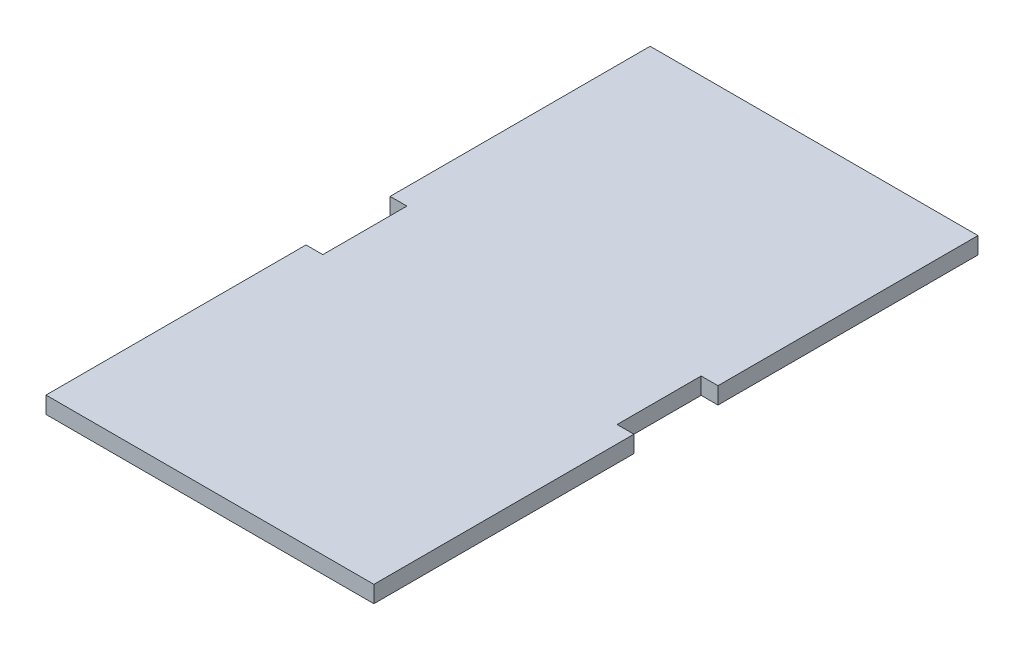
ISO-10303-21;
HEADER;
FILE_DESCRIPTION(('STEP AP214'),'2;1');
FILE_NAME('part.step','',(''),(''),'','','');
FILE_SCHEMA(('AUTOMOTIVE_DESIGN { 1 0 10303 214 1 1 1 1 }'));
ENDSEC;
DATA;
#1=APPLICATION_CONTEXT('core data for automotive mechanical design processes');
#2=APPLICATION_PROTOCOL_DEFINITION('international standard','automotive_design',2000,#1);
#3=PRODUCT_CONTEXT('',#1,'mechanical');
#4=PRODUCT('Part','Part','',(#3));
#5=PRODUCT_RELATED_PRODUCT_CATEGORY('part','',(#4));
#6=PRODUCT_DEFINITION_FORMATION('','',#4);
#7=PRODUCT_DEFINITION_CONTEXT('part definition',#1,'design');
#8=PRODUCT_DEFINITION('design','',#6,#7);
#9=PRODUCT_DEFINITION_SHAPE('','',#8);
#10=(LENGTH_UNIT() NAMED_UNIT(*) SI_UNIT(.MILLI.,.METRE.));
#11=(NAMED_UNIT(*) PLANE_ANGLE_UNIT() SI_UNIT($,.RADIAN.));
#12=(NAMED_UNIT(*) SI_UNIT($,.STERADIAN.) SOLID_ANGLE_UNIT());
#13=UNCERTAINTY_MEASURE_WITH_UNIT(LENGTH_MEASURE(1.E-05),#10,'distance_accuracy_value','');
#14=(GEOMETRIC_REPRESENTATION_CONTEXT(3) GLOBAL_UNCERTAINTY_ASSIGNED_CONTEXT((#13)) GLOBAL_UNIT_ASSIGNED_CONTEXT((#10,
#11,#12)) REPRESENTATION_CONTEXT('',''));
#15=CARTESIAN_POINT('',(0.,0.,0.));
#16=DIRECTION('',(0.,0.,1.));
#17=DIRECTION('',(1.,0.,0.));
#18=AXIS2_PLACEMENT_3D('',#15,#16,#17);
#19=CARTESIAN_POINT('',(44.45,5.08,0.));
#20=DIRECTION('',(1.,0.,0.));
#21=DIRECTION('',(0.,0.,-1.));
#22=AXIS2_PLACEMENT_3D('',#19,#20,#21);
#23=PLANE('',#22);
#24=DIRECTION('',(0.,0.,1.));
#25=VECTOR('',#24,1.);
#26=CARTESIAN_POINT('',(44.45,0.,0.));
#27=LINE('',#26,#25);
#28=CARTESIAN_POINT('',(44.45,0.,-12.7));
#29=VERTEX_POINT('',#28);
#30=CARTESIAN_POINT('',(44.45,0.,12.7));
#31=VERTEX_POINT('',#30);
#32=EDGE_CURVE('E152',#29,#31,#27,.T.);
#33=ORIENTED_EDGE('',*,*,#32,.F.);
#34=DIRECTION('',(0.,-1.,0.));
#35=VECTOR('',#34,1.);
#36=CARTESIAN_POINT('',(44.45,5.08,-12.7));
#37=LINE('',#36,#35);
#38=CARTESIAN_POINT('',(44.45,5.08,-12.7));
#39=VERTEX_POINT('',#38);
#40=EDGE_CURVE('E11',#39,#29,#37,.T.);
#41=ORIENTED_EDGE('',*,*,#40,.F.);
#42=DIRECTION('',(0.,0.,1.));
#43=VECTOR('',#42,1.);
#44=CARTESIAN_POINT('',(44.45,5.08,0.));
#45=LINE('',#44,#43);
#46=CARTESIAN_POINT('',(44.45,5.08,12.7));
#47=VERTEX_POINT('',#46);
#48=EDGE_CURVE('E183',#39,#47,#45,.T.);
#49=ORIENTED_EDGE('',*,*,#48,.T.);
#50=DIRECTION('',(0.,-1.,0.));
#51=VECTOR('',#50,1.);
#52=CARTESIAN_POINT('',(44.45,5.08,12.7));
#53=LINE('',#52,#51);
#54=EDGE_CURVE('E51',#47,#31,#53,.T.);
#55=ORIENTED_EDGE('',*,*,#54,.T.);
#56=EDGE_LOOP('',(#33,#41,#49,#55));
#57=FACE_BOUND('',#56,.T.);
#58=ADVANCED_FACE('F35',(#57),#23,.T.);
#59=CARTESIAN_POINT('',(0.,5.08,-12.6999999999999));
#60=DIRECTION('',(0.,0.,-1.));
#61=DIRECTION('',(-1.,0.,0.));
#62=AXIS2_PLACEMENT_3D('',#59,#60,#61);
#63=PLANE('',#62);
#64=DIRECTION('',(1.,0.,0.));
#65=VECTOR('',#64,1.);
#66=CARTESIAN_POINT('',(0.,0.,-12.6999999999999));
#67=LINE('',#66,#65);
#68=CARTESIAN_POINT('',(49.53,0.,-12.7));
#69=VERTEX_POINT('',#68);
#70=EDGE_CURVE('E154',#29,#69,#67,.T.);
#71=ORIENTED_EDGE('',*,*,#70,.T.);
#72=DIRECTION('',(0.,-1.,0.));
#73=VECTOR('',#72,1.);
#74=CARTESIAN_POINT('',(49.53,5.08,-12.7));
#75=LINE('',#74,#73);
#76=CARTESIAN_POINT('',(49.53,5.08,-12.7));
#77=VERTEX_POINT('',#76);
#78=EDGE_CURVE('E43',#77,#69,#75,.T.);
#79=ORIENTED_EDGE('',*,*,#78,.F.);
#80=DIRECTION('',(1.,0.,0.));
#81=VECTOR('',#80,1.);
#82=CARTESIAN_POINT('',(0.,5.08,-12.6999999999999));
#83=LINE('',#82,#81);
#84=EDGE_CURVE('E219',#39,#77,#83,.T.);
#85=ORIENTED_EDGE('',*,*,#84,.F.);
#86=ORIENTED_EDGE('',*,*,#40,.T.);
#87=EDGE_LOOP('',(#71,#79,#85,#86));
#88=FACE_BOUND('',#87,.T.);
#89=ADVANCED_FACE('F208',(#88),#63,.F.);
#90=CARTESIAN_POINT('',(49.53,5.08,0.));
#91=DIRECTION('',(1.,0.,0.));
#92=DIRECTION('',(0.,0.,-1.));
#93=AXIS2_PLACEMENT_3D('',#90,#91,#92);
#94=PLANE('',#93);
#95=DIRECTION('',(0.,0.,1.));
#96=VECTOR('',#95,1.);
#97=CARTESIAN_POINT('',(49.53,0.,0.));
#98=LINE('',#97,#96);
#99=CARTESIAN_POINT('',(49.53,0.,-91.2622));
#100=VERTEX_POINT('',#99);
#101=EDGE_CURVE('E157',#100,#69,#98,.T.);
#102=ORIENTED_EDGE('',*,*,#101,.F.);
#103=DIRECTION('',(0.,-1.,0.));
#104=VECTOR('',#103,1.);
#105=CARTESIAN_POINT('',(49.53,5.08,-91.2622));
#106=LINE('',#105,#104);
#107=CARTESIAN_POINT('',(49.53,5.08,-91.2622));
#108=VERTEX_POINT('',#107);
#109=EDGE_CURVE('E198',#108,#100,#106,.T.);
#110=ORIENTED_EDGE('',*,*,#109,.F.);
#111=DIRECTION('',(0.,0.,1.));
#112=VECTOR('',#111,1.);
#113=CARTESIAN_POINT('',(49.53,5.08,0.));
#114=LINE('',#113,#112);
#115=EDGE_CURVE('E205',#108,#77,#114,.T.);
#116=ORIENTED_EDGE('',*,*,#115,.T.);
#117=ORIENTED_EDGE('',*,*,#78,.T.);
#118=EDGE_LOOP('',(#102,#110,#116,#117));
#119=FACE_BOUND('',#118,.T.);
#120=ADVANCED_FACE('F203',(#119),#94,.T.);
#121=CARTESIAN_POINT('',(0.,5.08,-91.2622));
#122=DIRECTION('',(0.,0.,-1.));
#123=DIRECTION('',(-1.,0.,0.));
#124=AXIS2_PLACEMENT_3D('',#121,#122,#123);
#125=PLANE('',#124);
#126=DIRECTION('',(1.,0.,0.));
#127=VECTOR('',#126,1.);
#128=CARTESIAN_POINT('',(0.,0.,-91.2622));
#129=LINE('',#128,#127);
#130=CARTESIAN_POINT('',(-49.53,0.,-91.2622));
#131=VERTEX_POINT('',#130);
#132=EDGE_CURVE('E160',#131,#100,#129,.T.);
#133=ORIENTED_EDGE('',*,*,#132,.F.);
#134=DIRECTION('',(0.,-1.,0.));
#135=VECTOR('',#134,1.);
#136=CARTESIAN_POINT('',(-49.53,5.08,-91.2622));
#137=LINE('',#136,#135);
#138=CARTESIAN_POINT('',(-49.53,5.08,-91.2622));
#139=VERTEX_POINT('',#138);
#140=EDGE_CURVE('E196',#139,#131,#137,.T.);
#141=ORIENTED_EDGE('',*,*,#140,.F.);
#142=DIRECTION('',(1.,0.,0.));
#143=VECTOR('',#142,1.);
#144=CARTESIAN_POINT('',(0.,5.08,-91.2622));
#145=LINE('',#144,#143);
#146=EDGE_CURVE('E218',#139,#108,#145,.T.);
#147=ORIENTED_EDGE('',*,*,#146,.T.);
#148=ORIENTED_EDGE('',*,*,#109,.T.);
#149=EDGE_LOOP('',(#133,#141,#147,#148));
#150=FACE_BOUND('',#149,.T.);
#151=ADVANCED_FACE('F214',(#150),#125,.T.);
#152=CARTESIAN_POINT('',(-49.53,5.08,0.));
#153=DIRECTION('',(1.,0.,0.));
#154=DIRECTION('',(0.,0.,-1.));
#155=AXIS2_PLACEMENT_3D('',#152,#153,#154);
#156=PLANE('',#155);
#157=DIRECTION('',(0.,0.,1.));
#158=VECTOR('',#157,1.);
#159=CARTESIAN_POINT('',(-49.53,0.,0.));
#160=LINE('',#159,#158);
#161=CARTESIAN_POINT('',(-49.53,0.,-12.7));
#162=VERTEX_POINT('',#161);
#163=EDGE_CURVE('E163',#131,#162,#160,.T.);
#164=ORIENTED_EDGE('',*,*,#163,.T.);
#165=DIRECTION('',(0.,-1.,0.));
#166=VECTOR('',#165,1.);
#167=CARTESIAN_POINT('',(-49.53,5.08,-12.7));
#168=LINE('',#167,#166);
#169=CARTESIAN_POINT('',(-49.53,5.08,-12.7));
#170=VERTEX_POINT('',#169);
#171=EDGE_CURVE('E194',#170,#162,#168,.T.);
#172=ORIENTED_EDGE('',*,*,#171,.F.);
#173=DIRECTION('',(0.,0.,1.));
#174=VECTOR('',#173,1.);
#175=CARTESIAN_POINT('',(-49.53,5.08,0.));
#176=LINE('',#175,#174);
#177=EDGE_CURVE('E221',#139,#170,#176,.T.);
#178=ORIENTED_EDGE('',*,*,#177,.F.);
#179=ORIENTED_EDGE('',*,*,#140,.T.);
#180=EDGE_LOOP('',(#164,#172,#178,#179));
#181=FACE_BOUND('',#180,.T.);
#182=ADVANCED_FACE('F259',(#181),#156,.F.);
#183=CARTESIAN_POINT('',(0.,5.08,-12.7));
#184=DIRECTION('',(0.,0.,1.));
#185=DIRECTION('',(1.,0.,0.));
#186=AXIS2_PLACEMENT_3D('',#183,#184,#185);
#187=PLANE('',#186);
#188=DIRECTION('',(-1.,0.,0.));
#189=VECTOR('',#188,1.);
#190=CARTESIAN_POINT('',(0.,0.,-12.7));
#191=LINE('',#190,#189);
#192=CARTESIAN_POINT('',(-44.45,0.,-12.7));
#193=VERTEX_POINT('',#192);
#194=EDGE_CURVE('E166',#193,#162,#191,.T.);
#195=ORIENTED_EDGE('',*,*,#194,.F.);
#196=DIRECTION('',(0.,-1.,0.));
#197=VECTOR('',#196,1.);
#198=CARTESIAN_POINT('',(-44.45,5.08,-12.7));
#199=LINE('',#198,#197);
#200=CARTESIAN_POINT('',(-44.45,5.08,-12.7));
#201=VERTEX_POINT('',#200);
#202=EDGE_CURVE('E192',#201,#193,#199,.T.);
#203=ORIENTED_EDGE('',*,*,#202,.F.);
#204=DIRECTION('',(-1.,0.,0.));
#205=VECTOR('',#204,1.);
#206=CARTESIAN_POINT('',(0.,5.08,-12.7));
#207=LINE('',#206,#205);
#208=EDGE_CURVE('E227',#201,#170,#207,.T.);
#209=ORIENTED_EDGE('',*,*,#208,.T.);
#210=ORIENTED_EDGE('',*,*,#171,.T.);
#211=EDGE_LOOP('',(#195,#203,#209,#210));
#212=FACE_BOUND('',#211,.T.);
#213=ADVANCED_FACE('F262',(#212),#187,.T.);
#214=CARTESIAN_POINT('',(-44.45,5.08,0.));
#215=DIRECTION('',(1.,0.,0.));
#216=DIRECTION('',(0.,0.,-1.));
#217=AXIS2_PLACEMENT_3D('',#214,#215,#216);
#218=PLANE('',#217);
#219=DIRECTION('',(0.,0.,1.));
#220=VECTOR('',#219,1.);
#221=CARTESIAN_POINT('',(-44.45,0.,0.));
#222=LINE('',#221,#220);
#223=CARTESIAN_POINT('',(-44.45,0.,12.7));
#224=VERTEX_POINT('',#223);
#225=EDGE_CURVE('E169',#193,#224,#222,.T.);
#226=ORIENTED_EDGE('',*,*,#225,.T.);
#227=DIRECTION('',(0.,-1.,0.));
#228=VECTOR('',#227,1.);
#229=CARTESIAN_POINT('',(-44.45,5.08,12.7));
#230=LINE('',#229,#228);
#231=CARTESIAN_POINT('',(-44.45,5.08,12.7));
#232=VERTEX_POINT('',#231);
#233=EDGE_CURVE('E189',#232,#224,#230,.T.);
#234=ORIENTED_EDGE('',*,*,#233,.F.);
#235=DIRECTION('',(0.,0.,1.));
#236=VECTOR('',#235,1.);
#237=CARTESIAN_POINT('',(-44.45,5.08,0.));
#238=LINE('',#237,#236);
#239=EDGE_CURVE('E230',#201,#232,#238,.T.);
#240=ORIENTED_EDGE('',*,*,#239,.F.);
#241=ORIENTED_EDGE('',*,*,#202,.T.);
#242=EDGE_LOOP('',(#226,#234,#240,#241));
#243=FACE_BOUND('',#242,.T.);
#244=ADVANCED_FACE('F266',(#243),#218,.F.);
#245=CARTESIAN_POINT('',(0.,5.08,12.7));
#246=DIRECTION('',(0.,0.,1.));
#247=DIRECTION('',(1.,0.,0.));
#248=AXIS2_PLACEMENT_3D('',#245,#246,#247);
#249=PLANE('',#248);
#250=DIRECTION('',(-1.,0.,0.));
#251=VECTOR('',#250,1.);
#252=CARTESIAN_POINT('',(0.,0.,12.7));
#253=LINE('',#252,#251);
#254=CARTESIAN_POINT('',(-49.53,0.,12.7));
#255=VERTEX_POINT('',#254);
#256=EDGE_CURVE('E171',#224,#255,#253,.T.);
#257=ORIENTED_EDGE('',*,*,#256,.T.);
#258=DIRECTION('',(0.,-1.,0.));
#259=VECTOR('',#258,1.);
#260=CARTESIAN_POINT('',(-49.53,5.08,12.7));
#261=LINE('',#260,#259);
#262=CARTESIAN_POINT('',(-49.53,5.08,12.7));
#263=VERTEX_POINT('',#262);
#264=EDGE_CURVE('E187',#263,#255,#261,.T.);
#265=ORIENTED_EDGE('',*,*,#264,.F.);
#266=DIRECTION('',(-1.,0.,0.));
#267=VECTOR('',#266,1.);
#268=CARTESIAN_POINT('',(0.,5.08,12.7));
#269=LINE('',#268,#267);
#270=EDGE_CURVE('E232',#232,#263,#269,.T.);
#271=ORIENTED_EDGE('',*,*,#270,.F.);
#272=ORIENTED_EDGE('',*,*,#233,.T.);
#273=EDGE_LOOP('',(#257,#265,#271,#272));
#274=FACE_BOUND('',#273,.T.);
#275=ADVANCED_FACE('F270',(#274),#249,.F.);
#276=CARTESIAN_POINT('',(-49.53,5.08,0.));
#277=DIRECTION('',(-1.,0.,0.));
#278=DIRECTION('',(0.,0.,1.));
#279=AXIS2_PLACEMENT_3D('',#276,#277,#278);
#280=PLANE('',#279);
#281=DIRECTION('',(0.,0.,-1.));
#282=VECTOR('',#281,1.);
#283=CARTESIAN_POINT('',(-49.53,0.,0.));
#284=LINE('',#283,#282);
#285=CARTESIAN_POINT('',(-49.53,0.,91.2622));
#286=VERTEX_POINT('',#285);
#287=EDGE_CURVE('E174',#286,#255,#284,.T.);
#288=ORIENTED_EDGE('',*,*,#287,.F.);
#289=DIRECTION('',(0.,-1.,0.));
#290=VECTOR('',#289,1.);
#291=CARTESIAN_POINT('',(-49.53,5.08,91.2622));
#292=LINE('',#291,#290);
#293=CARTESIAN_POINT('',(-49.53,5.08,91.2622));
#294=VERTEX_POINT('',#293);
#295=EDGE_CURVE('E144',#294,#286,#292,.T.);
#296=ORIENTED_EDGE('',*,*,#295,.F.);
#297=DIRECTION('',(0.,0.,-1.));
#298=VECTOR('',#297,1.);
#299=CARTESIAN_POINT('',(-49.53,5.08,0.));
#300=LINE('',#299,#298);
#301=EDGE_CURVE('E134',#294,#263,#300,.T.);
#302=ORIENTED_EDGE('',*,*,#301,.T.);
#303=ORIENTED_EDGE('',*,*,#264,.T.);
#304=EDGE_LOOP('',(#288,#296,#302,#303));
#305=FACE_BOUND('',#304,.T.);
#306=ADVANCED_FACE('F235',(#305),#280,.T.);
#307=CARTESIAN_POINT('',(0.,5.08,91.2622));
#308=DIRECTION('',(0.,0.,-1.));
#309=DIRECTION('',(-1.,0.,0.));
#310=AXIS2_PLACEMENT_3D('',#307,#308,#309);
#311=PLANE('',#310);
#312=DIRECTION('',(1.,0.,0.));
#313=VECTOR('',#312,1.);
#314=CARTESIAN_POINT('',(0.,0.,91.2622));
#315=LINE('',#314,#313);
#316=CARTESIAN_POINT('',(49.53,0.,91.2622));
#317=VERTEX_POINT('',#316);
#318=EDGE_CURVE('E141',#286,#317,#315,.T.);
#319=ORIENTED_EDGE('',*,*,#318,.T.);
#320=DIRECTION('',(0.,-1.,0.));
#321=VECTOR('',#320,1.);
#322=CARTESIAN_POINT('',(49.53,5.08,91.2622));
#323=LINE('',#322,#321);
#324=CARTESIAN_POINT('',(49.53,5.08,91.2622));
#325=VERTEX_POINT('',#324);
#326=EDGE_CURVE('E138',#325,#317,#323,.T.);
#327=ORIENTED_EDGE('',*,*,#326,.F.);
#328=DIRECTION('',(1.,0.,0.));
#329=VECTOR('',#328,1.);
#330=CARTESIAN_POINT('',(0.,5.08,91.2622));
#331=LINE('',#330,#329);
#332=EDGE_CURVE('E126',#294,#325,#331,.T.);
#333=ORIENTED_EDGE('',*,*,#332,.F.);
#334=ORIENTED_EDGE('',*,*,#295,.T.);
#335=EDGE_LOOP('',(#319,#327,#333,#334));
#336=FACE_BOUND('',#335,.T.);
#337=ADVANCED_FACE('F139',(#336),#311,.F.);
#338=CARTESIAN_POINT('',(49.53,5.08,0.));
#339=DIRECTION('',(-1.,0.,0.));
#340=DIRECTION('',(0.,0.,1.));
#341=AXIS2_PLACEMENT_3D('',#338,#339,#340);
#342=PLANE('',#341);
#343=DIRECTION('',(0.,0.,-1.));
#344=VECTOR('',#343,1.);
#345=CARTESIAN_POINT('',(49.53,0.,0.));
#346=LINE('',#345,#344);
#347=CARTESIAN_POINT('',(49.53,0.,12.7));
#348=VERTEX_POINT('',#347);
#349=EDGE_CURVE('E178',#317,#348,#346,.T.);
#350=ORIENTED_EDGE('',*,*,#349,.T.);
#351=DIRECTION('',(0.,-1.,0.));
#352=VECTOR('',#351,1.);
#353=CARTESIAN_POINT('',(49.53,5.08,12.7));
#354=LINE('',#353,#352);
#355=CARTESIAN_POINT('',(49.53,5.08,12.7));
#356=VERTEX_POINT('',#355);
#357=EDGE_CURVE('E89',#356,#348,#354,.T.);
#358=ORIENTED_EDGE('',*,*,#357,.F.);
#359=DIRECTION('',(0.,0.,-1.));
#360=VECTOR('',#359,1.);
#361=CARTESIAN_POINT('',(49.53,5.08,0.));
#362=LINE('',#361,#360);
#363=EDGE_CURVE('E132',#325,#356,#362,.T.);
#364=ORIENTED_EDGE('',*,*,#363,.F.);
#365=ORIENTED_EDGE('',*,*,#326,.T.);
#366=EDGE_LOOP('',(#350,#358,#364,#365));
#367=FACE_BOUND('',#366,.T.);
#368=ADVANCED_FACE('F146',(#367),#342,.F.);
#369=CARTESIAN_POINT('',(0.,5.08,12.7));
#370=DIRECTION('',(0.,0.,-1.));
#371=DIRECTION('',(-1.,0.,0.));
#372=AXIS2_PLACEMENT_3D('',#369,#370,#371);
#373=PLANE('',#372);
#374=DIRECTION('',(1.,0.,0.));
#375=VECTOR('',#374,1.);
#376=CARTESIAN_POINT('',(0.,0.,12.7));
#377=LINE('',#376,#375);
#378=EDGE_CURVE('E180',#31,#348,#377,.T.);
#379=ORIENTED_EDGE('',*,*,#378,.F.);
#380=ORIENTED_EDGE('',*,*,#54,.F.);
#381=DIRECTION('',(1.,0.,0.));
#382=VECTOR('',#381,1.);
#383=CARTESIAN_POINT('',(0.,5.08,12.7));
#384=LINE('',#383,#382);
#385=EDGE_CURVE('E147',#47,#356,#384,.T.);
#386=ORIENTED_EDGE('',*,*,#385,.T.);
#387=ORIENTED_EDGE('',*,*,#357,.T.);
#388=EDGE_LOOP('',(#379,#380,#386,#387));
#389=FACE_BOUND('',#388,.T.);
#390=ADVANCED_FACE('F238',(#389),#373,.T.);
#391=CARTESIAN_POINT('',(0.,5.08,0.));
#392=DIRECTION('',(0.,1.,0.));
#393=DIRECTION('',(0.,0.,1.));
#394=AXIS2_PLACEMENT_3D('',#391,#392,#393);
#395=PLANE('',#394);
#396=ORIENTED_EDGE('',*,*,#48,.F.);
#397=ORIENTED_EDGE('',*,*,#84,.T.);
#398=ORIENTED_EDGE('',*,*,#115,.F.);
#399=ORIENTED_EDGE('',*,*,#146,.F.);
#400=ORIENTED_EDGE('',*,*,#177,.T.);
#401=ORIENTED_EDGE('',*,*,#208,.F.);
#402=ORIENTED_EDGE('',*,*,#239,.T.);
#403=ORIENTED_EDGE('',*,*,#270,.T.);
#404=ORIENTED_EDGE('',*,*,#301,.F.);
#405=ORIENTED_EDGE('',*,*,#332,.T.);
#406=ORIENTED_EDGE('',*,*,#363,.T.);
#407=ORIENTED_EDGE('',*,*,#385,.F.);
#408=EDGE_LOOP('',(#396,#397,#398,#399,#400,#401,#402,#403,#404,#405,#406,#407));
#409=FACE_BOUND('',#408,.T.);
#410=ADVANCED_FACE('F129',(#409),#395,.T.);
#411=CARTESIAN_POINT('',(0.,0.,0.));
#412=DIRECTION('',(0.,1.,0.));
#413=DIRECTION('',(0.,0.,1.));
#414=AXIS2_PLACEMENT_3D('',#411,#412,#413);
#415=PLANE('',#414);
#416=ORIENTED_EDGE('',*,*,#32,.T.);
#417=ORIENTED_EDGE('',*,*,#378,.T.);
#418=ORIENTED_EDGE('',*,*,#349,.F.);
#419=ORIENTED_EDGE('',*,*,#318,.F.);
#420=ORIENTED_EDGE('',*,*,#287,.T.);
#421=ORIENTED_EDGE('',*,*,#256,.F.);
#422=ORIENTED_EDGE('',*,*,#225,.F.);
#423=ORIENTED_EDGE('',*,*,#194,.T.);
#424=ORIENTED_EDGE('',*,*,#163,.F.);
#425=ORIENTED_EDGE('',*,*,#132,.T.);
#426=ORIENTED_EDGE('',*,*,#101,.T.);
#427=ORIENTED_EDGE('',*,*,#70,.F.);
#428=EDGE_LOOP('',(#416,#417,#418,#419,#420,#421,#422,#423,#424,#425,#426,#427));
#429=FACE_BOUND('',#428,.T.);
#430=ADVANCED_FACE('F210',(#429),#415,.F.);
#431=CLOSED_SHELL('',(#58,#89,#120,#151,#182,#213,#244,#275,#306,#337,#368,#390,#410,#430));
#432=MANIFOLD_SOLID_BREP('B2',#431);
#433=ADVANCED_BREP_SHAPE_REPRESENTATION('',(#18,#432),#14);
#434=SHAPE_DEFINITION_REPRESENTATION(#9,#433);
ENDSEC;
END-ISO-10303-21;
